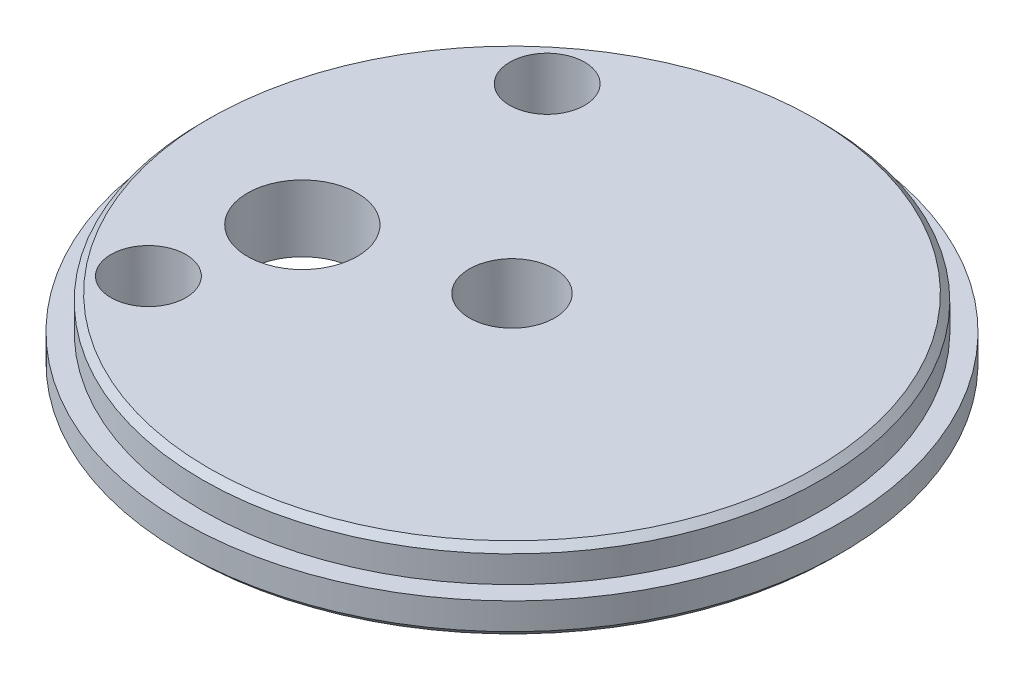
ISO-10303-21;
HEADER;
FILE_DESCRIPTION(('STEP AP214'),'2;1');
FILE_NAME('part.step','',(''),(''),'','','');
FILE_SCHEMA(('AUTOMOTIVE_DESIGN { 1 0 10303 214 1 1 1 1 }'));
ENDSEC;
DATA;
#1=APPLICATION_CONTEXT('core data for automotive mechanical design processes');
#2=APPLICATION_PROTOCOL_DEFINITION('international standard','automotive_design',2000,#1);
#3=PRODUCT_CONTEXT('',#1,'mechanical');
#4=PRODUCT('Part','Part','',(#3));
#5=PRODUCT_RELATED_PRODUCT_CATEGORY('part','',(#4));
#6=PRODUCT_DEFINITION_FORMATION('','',#4);
#7=PRODUCT_DEFINITION_CONTEXT('part definition',#1,'design');
#8=PRODUCT_DEFINITION('design','',#6,#7);
#9=PRODUCT_DEFINITION_SHAPE('','',#8);
#10=(LENGTH_UNIT() NAMED_UNIT(*) SI_UNIT(.MILLI.,.METRE.));
#11=(NAMED_UNIT(*) PLANE_ANGLE_UNIT() SI_UNIT($,.RADIAN.));
#12=(NAMED_UNIT(*) SI_UNIT($,.STERADIAN.) SOLID_ANGLE_UNIT());
#13=UNCERTAINTY_MEASURE_WITH_UNIT(LENGTH_MEASURE(1.E-05),#10,'distance_accuracy_value','');
#14=(GEOMETRIC_REPRESENTATION_CONTEXT(3) GLOBAL_UNCERTAINTY_ASSIGNED_CONTEXT((#13)) GLOBAL_UNIT_ASSIGNED_CONTEXT((#10,
#11,#12)) REPRESENTATION_CONTEXT('',''));
#15=CARTESIAN_POINT('',(0.,0.,0.));
#16=DIRECTION('',(0.,0.,1.));
#17=DIRECTION('',(1.,0.,0.));
#18=AXIS2_PLACEMENT_3D('',#15,#16,#17);
#19=CARTESIAN_POINT('',(0.,2.54,0.));
#20=DIRECTION('',(0.,-1.,0.));
#21=DIRECTION('',(0.,0.,-1.));
#22=AXIS2_PLACEMENT_3D('',#19,#20,#21);
#23=CYLINDRICAL_SURFACE('',#22,25.146);
#24=CARTESIAN_POINT('',(0.,0.508000000000008,0.));
#25=DIRECTION('',(0.,1.,0.));
#26=DIRECTION('',(0.,0.,1.));
#27=AXIS2_PLACEMENT_3D('',#24,#25,#26);
#28=CIRCLE('',#27,25.146);
#29=CARTESIAN_POINT('',(0.,0.508000000000008,25.146));
#30=VERTEX_POINT('',#29);
#31=EDGE_CURVE('E60',#30,#30,#28,.T.);
#32=ORIENTED_EDGE('',*,*,#31,.T.);
#33=EDGE_LOOP('',(#32));
#34=FACE_BOUND('',#33,.T.);
#35=CARTESIAN_POINT('',(0.,2.54,0.));
#36=DIRECTION('',(0.,1.,0.));
#37=DIRECTION('',(0.,0.,1.));
#38=AXIS2_PLACEMENT_3D('',#35,#36,#37);
#39=CIRCLE('',#38,25.146);
#40=CARTESIAN_POINT('',(0.,2.54,25.146));
#41=VERTEX_POINT('',#40);
#42=EDGE_CURVE('E78',#41,#41,#39,.T.);
#43=ORIENTED_EDGE('',*,*,#42,.F.);
#44=EDGE_LOOP('',(#43));
#45=FACE_BOUND('',#44,.T.);
#46=ADVANCED_FACE('F51',(#34,#45),#23,.T.);
#47=CARTESIAN_POINT('',(0.,2.54,0.));
#48=DIRECTION('',(0.,1.,0.));
#49=DIRECTION('',(0.,0.,1.));
#50=AXIS2_PLACEMENT_3D('',#47,#48,#49);
#51=PLANE('',#50);
#52=CARTESIAN_POINT('',(0.,2.54,0.));
#53=DIRECTION('',(0.,1.,0.));
#54=DIRECTION('',(0.,0.,1.));
#55=AXIS2_PLACEMENT_3D('',#52,#53,#54);
#56=CIRCLE('',#55,23.622);
#57=CARTESIAN_POINT('',(0.,2.54,23.622));
#58=VERTEX_POINT('',#57);
#59=EDGE_CURVE('E77',#58,#58,#56,.T.);
#60=ORIENTED_EDGE('',*,*,#59,.F.);
#61=EDGE_LOOP('',(#60));
#62=FACE_BOUND('',#61,.T.);
#63=ORIENTED_EDGE('',*,*,#42,.T.);
#64=EDGE_LOOP('',(#63));
#65=FACE_BOUND('',#64,.T.);
#66=ADVANCED_FACE('F124',(#62,#65),#51,.T.);
#67=CARTESIAN_POINT('',(0.,0.,0.));
#68=DIRECTION('',(0.,1.,0.));
#69=DIRECTION('',(0.,0.,1.));
#70=AXIS2_PLACEMENT_3D('',#67,#68,#69);
#71=PLANE('',#70);
#72=CARTESIAN_POINT('',(0.,0.,0.));
#73=DIRECTION('',(0.,1.,0.));
#74=DIRECTION('',(0.,0.,1.));
#75=AXIS2_PLACEMENT_3D('',#72,#73,#74);
#76=CIRCLE('',#75,24.638);
#77=CARTESIAN_POINT('',(0.,0.,24.638));
#78=VERTEX_POINT('',#77);
#79=EDGE_CURVE('E10',#78,#78,#76,.F.);
#80=ORIENTED_EDGE('',*,*,#79,.T.);
#81=EDGE_LOOP('',(#80));
#82=FACE_BOUND('',#81,.T.);
#83=CARTESIAN_POINT('',(-12.5125606875358,0.,-15.1965473065672));
#84=DIRECTION('',(0.,-1.,0.));
#85=DIRECTION('',(0.,0.,-1.));
#86=AXIS2_PLACEMENT_3D('',#83,#84,#85);
#87=CIRCLE('',#86,2.8575);
#88=CARTESIAN_POINT('',(-12.5125606875358,0.,-18.0540473065672));
#89=VERTEX_POINT('',#88);
#90=EDGE_CURVE('E105',#89,#89,#87,.T.);
#91=ORIENTED_EDGE('',*,*,#90,.F.);
#92=EDGE_LOOP('',(#91));
#93=FACE_BOUND('',#92,.T.);
#94=CARTESIAN_POINT('',(-15.0190301032054,0.,12.7250917387267));
#95=DIRECTION('',(0.,-1.,0.));
#96=DIRECTION('',(0.,0.,-1.));
#97=AXIS2_PLACEMENT_3D('',#94,#95,#96);
#98=CIRCLE('',#97,2.8575);
#99=CARTESIAN_POINT('',(-15.0190301032054,0.,9.86759173872673));
#100=VERTEX_POINT('',#99);
#101=EDGE_CURVE('E101',#100,#100,#98,.T.);
#102=ORIENTED_EDGE('',*,*,#101,.F.);
#103=EDGE_LOOP('',(#102));
#104=FACE_BOUND('',#103,.T.);
#105=CARTESIAN_POINT('',(0.,0.,0.));
#106=DIRECTION('',(0.,1.,0.));
#107=DIRECTION('',(0.,0.,1.));
#108=AXIS2_PLACEMENT_3D('',#105,#106,#107);
#109=CIRCLE('',#108,3.2512);
#110=CARTESIAN_POINT('',(0.,0.,3.2512));
#111=VERTEX_POINT('',#110);
#112=EDGE_CURVE('E81',#111,#111,#109,.T.);
#113=ORIENTED_EDGE('',*,*,#112,.T.);
#114=EDGE_LOOP('',(#113));
#115=FACE_BOUND('',#114,.T.);
#116=CARTESIAN_POINT('',(-12.537653487105,0.,3.45997073997446));
#117=DIRECTION('',(0.,1.,0.));
#118=DIRECTION('',(0.,0.,1.));
#119=AXIS2_PLACEMENT_3D('',#116,#117,#118);
#120=CIRCLE('',#119,4.191);
#121=CARTESIAN_POINT('',(-12.537653487105,0.,7.65097073997446));
#122=VERTEX_POINT('',#121);
#123=EDGE_CURVE('E88',#122,#122,#120,.T.);
#124=ORIENTED_EDGE('',*,*,#123,.T.);
#125=EDGE_LOOP('',(#124));
#126=FACE_BOUND('',#125,.T.);
#127=ADVANCED_FACE('F120',(#82,#93,#104,#115,#126),#71,.F.);
#128=CARTESIAN_POINT('',(0.,5.08,0.));
#129=DIRECTION('',(0.,-1.,0.));
#130=DIRECTION('',(0.,0.,-1.));
#131=AXIS2_PLACEMENT_3D('',#128,#129,#130);
#132=CYLINDRICAL_SURFACE('',#131,23.622);
#133=CARTESIAN_POINT('',(0.,4.572,0.));
#134=DIRECTION('',(0.,1.,0.));
#135=DIRECTION('',(0.,0.,1.));
#136=AXIS2_PLACEMENT_3D('',#133,#134,#135);
#137=CIRCLE('',#136,23.622);
#138=CARTESIAN_POINT('',(0.,4.572,23.622));
#139=VERTEX_POINT('',#138);
#140=EDGE_CURVE('E65',#139,#139,#137,.F.);
#141=ORIENTED_EDGE('',*,*,#140,.T.);
#142=EDGE_LOOP('',(#141));
#143=FACE_BOUND('',#142,.T.);
#144=ORIENTED_EDGE('',*,*,#59,.T.);
#145=EDGE_LOOP('',(#144));
#146=FACE_BOUND('',#145,.T.);
#147=ADVANCED_FACE('F123',(#143,#146),#132,.T.);
#148=CARTESIAN_POINT('',(0.,5.08,0.));
#149=DIRECTION('',(0.,1.,0.));
#150=DIRECTION('',(0.,0.,1.));
#151=AXIS2_PLACEMENT_3D('',#148,#149,#150);
#152=PLANE('',#151);
#153=CARTESIAN_POINT('',(0.,5.08,0.));
#154=DIRECTION('',(0.,1.,0.));
#155=DIRECTION('',(0.,0.,1.));
#156=AXIS2_PLACEMENT_3D('',#153,#154,#155);
#157=CIRCLE('',#156,23.114);
#158=CARTESIAN_POINT('',(0.,5.08,23.114));
#159=VERTEX_POINT('',#158);
#160=EDGE_CURVE('E71',#159,#159,#157,.T.);
#161=ORIENTED_EDGE('',*,*,#160,.T.);
#162=EDGE_LOOP('',(#161));
#163=FACE_BOUND('',#162,.T.);
#164=CARTESIAN_POINT('',(-12.5125606875358,5.08,-15.1965473065672));
#165=DIRECTION('',(0.,1.,0.));
#166=DIRECTION('',(0.,0.,1.));
#167=AXIS2_PLACEMENT_3D('',#164,#165,#166);
#168=CIRCLE('',#167,2.8575);
#169=CARTESIAN_POINT('',(-12.5125606875358,5.08,-12.3390473065672));
#170=VERTEX_POINT('',#169);
#171=EDGE_CURVE('E97',#170,#170,#168,.F.);
#172=ORIENTED_EDGE('',*,*,#171,.T.);
#173=EDGE_LOOP('',(#172));
#174=FACE_BOUND('',#173,.T.);
#175=CARTESIAN_POINT('',(-15.0190301032054,5.08,12.7250917387267));
#176=DIRECTION('',(0.,1.,0.));
#177=DIRECTION('',(0.,0.,1.));
#178=AXIS2_PLACEMENT_3D('',#175,#176,#177);
#179=CIRCLE('',#178,2.8575);
#180=CARTESIAN_POINT('',(-15.0190301032054,5.08,15.5825917387267));
#181=VERTEX_POINT('',#180);
#182=EDGE_CURVE('E106',#181,#181,#179,.F.);
#183=ORIENTED_EDGE('',*,*,#182,.T.);
#184=EDGE_LOOP('',(#183));
#185=FACE_BOUND('',#184,.T.);
#186=CARTESIAN_POINT('',(0.,5.08,0.));
#187=DIRECTION('',(0.,-1.,0.));
#188=DIRECTION('',(0.,0.,-1.));
#189=AXIS2_PLACEMENT_3D('',#186,#187,#188);
#190=CIRCLE('',#189,3.2512);
#191=CARTESIAN_POINT('',(0.,5.08,-3.2512));
#192=VERTEX_POINT('',#191);
#193=EDGE_CURVE('E92',#192,#192,#190,.T.);
#194=ORIENTED_EDGE('',*,*,#193,.T.);
#195=EDGE_LOOP('',(#194));
#196=FACE_BOUND('',#195,.T.);
#197=CARTESIAN_POINT('',(-12.537653487105,5.08,3.45997073997446));
#198=DIRECTION('',(0.,-1.,0.));
#199=DIRECTION('',(0.,0.,-1.));
#200=AXIS2_PLACEMENT_3D('',#197,#198,#199);
#201=CIRCLE('',#200,4.191);
#202=CARTESIAN_POINT('',(-12.537653487105,5.08,-0.731029260025539));
#203=VERTEX_POINT('',#202);
#204=EDGE_CURVE('E93',#203,#203,#201,.T.);
#205=ORIENTED_EDGE('',*,*,#204,.T.);
#206=EDGE_LOOP('',(#205));
#207=FACE_BOUND('',#206,.T.);
#208=ADVANCED_FACE('F135',(#163,#174,#185,#196,#207),#152,.T.);
#209=CARTESIAN_POINT('',(-12.537653487105,5.08,3.45997073997446));
#210=DIRECTION('',(0.,-1.,0.));
#211=DIRECTION('',(0.,0.,-1.));
#212=AXIS2_PLACEMENT_3D('',#209,#210,#211);
#213=CYLINDRICAL_SURFACE('',#212,4.191);
#214=ORIENTED_EDGE('',*,*,#204,.F.);
#215=EDGE_LOOP('',(#214));
#216=FACE_BOUND('',#215,.T.);
#217=ORIENTED_EDGE('',*,*,#123,.F.);
#218=EDGE_LOOP('',(#217));
#219=FACE_BOUND('',#218,.T.);
#220=ADVANCED_FACE('F132',(#216,#219),#213,.F.);
#221=CARTESIAN_POINT('',(0.,5.08,0.));
#222=DIRECTION('',(0.,-1.,0.));
#223=DIRECTION('',(0.,0.,-1.));
#224=AXIS2_PLACEMENT_3D('',#221,#222,#223);
#225=CYLINDRICAL_SURFACE('',#224,3.2512);
#226=ORIENTED_EDGE('',*,*,#193,.F.);
#227=EDGE_LOOP('',(#226));
#228=FACE_BOUND('',#227,.T.);
#229=ORIENTED_EDGE('',*,*,#112,.F.);
#230=EDGE_LOOP('',(#229));
#231=FACE_BOUND('',#230,.T.);
#232=ADVANCED_FACE('F134',(#228,#231),#225,.F.);
#233=CARTESIAN_POINT('',(-15.0190301032054,13.1622305089623,12.7250917387267));
#234=DIRECTION('',(0.,-1.,0.));
#235=DIRECTION('',(0.,0.,-1.));
#236=AXIS2_PLACEMENT_3D('',#233,#234,#235);
#237=CYLINDRICAL_SURFACE('',#236,2.8575);
#238=ORIENTED_EDGE('',*,*,#101,.T.);
#239=EDGE_LOOP('',(#238));
#240=FACE_BOUND('',#239,.T.);
#241=ORIENTED_EDGE('',*,*,#182,.F.);
#242=EDGE_LOOP('',(#241));
#243=FACE_BOUND('',#242,.T.);
#244=ADVANCED_FACE('F142',(#240,#243),#237,.F.);
#245=CARTESIAN_POINT('',(-12.5125606875358,13.1622305089623,-15.1965473065672));
#246=DIRECTION('',(0.,-1.,0.));
#247=DIRECTION('',(0.,0.,-1.));
#248=AXIS2_PLACEMENT_3D('',#245,#246,#247);
#249=CYLINDRICAL_SURFACE('',#248,2.8575);
#250=ORIENTED_EDGE('',*,*,#90,.T.);
#251=EDGE_LOOP('',(#250));
#252=FACE_BOUND('',#251,.T.);
#253=ORIENTED_EDGE('',*,*,#171,.F.);
#254=EDGE_LOOP('',(#253));
#255=FACE_BOUND('',#254,.T.);
#256=ADVANCED_FACE('F117',(#252,#255),#249,.F.);
#257=CARTESIAN_POINT('',(0.,5.08,0.));
#258=DIRECTION('',(0.,-1.,0.));
#259=DIRECTION('',(0.,0.,-1.));
#260=AXIS2_PLACEMENT_3D('',#257,#258,#259);
#261=CONICAL_SURFACE('',#260,23.114,0.785398163397442);
#262=ORIENTED_EDGE('',*,*,#140,.F.);
#263=EDGE_LOOP('',(#262));
#264=FACE_BOUND('',#263,.T.);
#265=ORIENTED_EDGE('',*,*,#160,.F.);
#266=EDGE_LOOP('',(#265));
#267=FACE_BOUND('',#266,.T.);
#268=ADVANCED_FACE('F159',(#264,#267),#261,.T.);
#269=CARTESIAN_POINT('',(0.,0.508000000000008,0.));
#270=DIRECTION('',(0.,1.,0.));
#271=DIRECTION('',(0.,0.,1.));
#272=AXIS2_PLACEMENT_3D('',#269,#270,#271);
#273=CONICAL_SURFACE('',#272,25.146,0.785398163397442);
#274=ORIENTED_EDGE('',*,*,#79,.F.);
#275=EDGE_LOOP('',(#274));
#276=FACE_BOUND('',#275,.T.);
#277=ORIENTED_EDGE('',*,*,#31,.F.);
#278=EDGE_LOOP('',(#277));
#279=FACE_BOUND('',#278,.T.);
#280=ADVANCED_FACE('F54',(#276,#279),#273,.T.);
#281=CLOSED_SHELL('',(#46,#66,#127,#147,#208,#220,#232,#244,#256,#268,#280));
#282=MANIFOLD_SOLID_BREP('B2',#281);
#283=ADVANCED_BREP_SHAPE_REPRESENTATION('',(#18,#282),#14);
#284=SHAPE_DEFINITION_REPRESENTATION(#9,#283);
ENDSEC;
END-ISO-10303-21;
